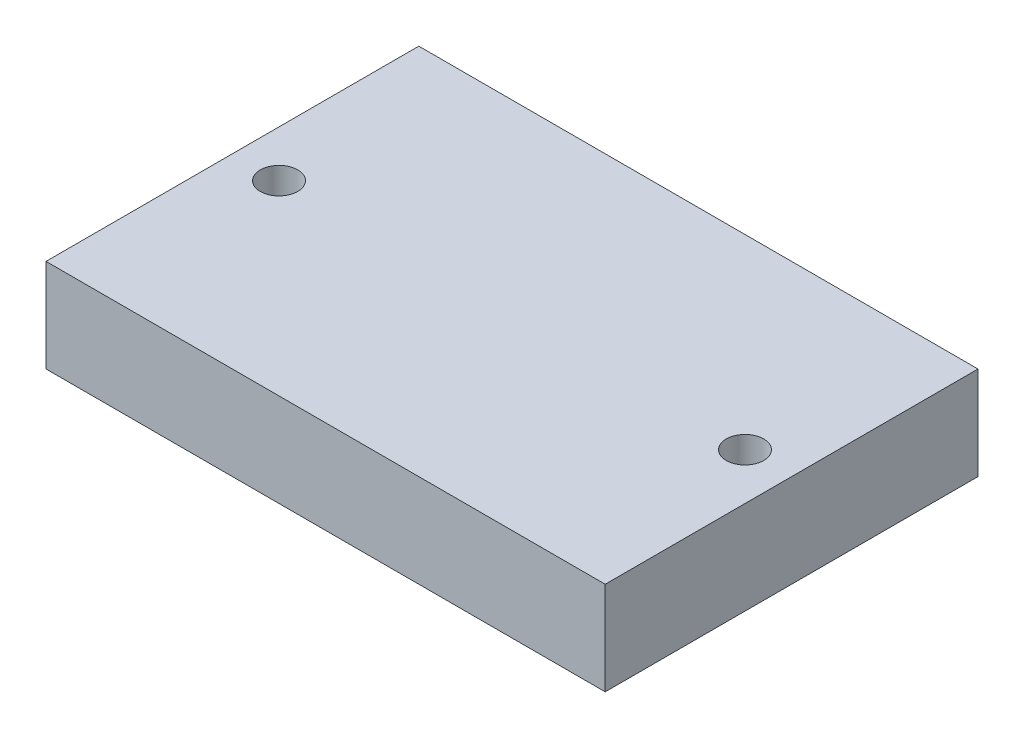
ISO-10303-21;
HEADER;
FILE_DESCRIPTION(('STEP AP214'),'2;1');
FILE_NAME('part.step','',(''),(''),'','','');
FILE_SCHEMA(('AUTOMOTIVE_DESIGN { 1 0 10303 214 1 1 1 1 }'));
ENDSEC;
DATA;
#1=APPLICATION_CONTEXT('core data for automotive mechanical design processes');
#2=APPLICATION_PROTOCOL_DEFINITION('international standard','automotive_design',2000,#1);
#3=PRODUCT_CONTEXT('',#1,'mechanical');
#4=PRODUCT('Part','Part','',(#3));
#5=PRODUCT_RELATED_PRODUCT_CATEGORY('part','',(#4));
#6=PRODUCT_DEFINITION_FORMATION('','',#4);
#7=PRODUCT_DEFINITION_CONTEXT('part definition',#1,'design');
#8=PRODUCT_DEFINITION('design','',#6,#7);
#9=PRODUCT_DEFINITION_SHAPE('','',#8);
#10=(LENGTH_UNIT() NAMED_UNIT(*) SI_UNIT(.MILLI.,.METRE.));
#11=(NAMED_UNIT(*) PLANE_ANGLE_UNIT() SI_UNIT($,.RADIAN.));
#12=(NAMED_UNIT(*) SI_UNIT($,.STERADIAN.) SOLID_ANGLE_UNIT());
#13=UNCERTAINTY_MEASURE_WITH_UNIT(LENGTH_MEASURE(1.E-05),#10,'distance_accuracy_value','');
#14=(GEOMETRIC_REPRESENTATION_CONTEXT(3) GLOBAL_UNCERTAINTY_ASSIGNED_CONTEXT((#13)) GLOBAL_UNIT_ASSIGNED_CONTEXT((#10,
#11,#12)) REPRESENTATION_CONTEXT('',''));
#15=CARTESIAN_POINT('',(0.,0.,0.));
#16=DIRECTION('',(0.,0.,1.));
#17=DIRECTION('',(1.,0.,0.));
#18=AXIS2_PLACEMENT_3D('',#15,#16,#17);
#19=CARTESIAN_POINT('',(-38.1,12.7,25.4));
#20=DIRECTION('',(-1.,0.,0.));
#21=DIRECTION('',(0.,0.,1.));
#22=AXIS2_PLACEMENT_3D('',#19,#20,#21);
#23=PLANE('',#22);
#24=DIRECTION('',(0.,0.,-1.));
#25=VECTOR('',#24,1.);
#26=CARTESIAN_POINT('',(-38.1,0.,25.4));
#27=LINE('',#26,#25);
#28=CARTESIAN_POINT('',(-38.1,0.,25.4));
#29=VERTEX_POINT('',#28);
#30=CARTESIAN_POINT('',(-38.1,0.,-25.4));
#31=VERTEX_POINT('',#30);
#32=EDGE_CURVE('E105',#29,#31,#27,.T.);
#33=ORIENTED_EDGE('',*,*,#32,.F.);
#34=DIRECTION('',(0.,-1.,0.));
#35=VECTOR('',#34,1.);
#36=CARTESIAN_POINT('',(-38.1,12.7,25.4));
#37=LINE('',#36,#35);
#38=CARTESIAN_POINT('',(-38.1,12.7,25.4));
#39=VERTEX_POINT('',#38);
#40=EDGE_CURVE('E11',#39,#29,#37,.T.);
#41=ORIENTED_EDGE('',*,*,#40,.F.);
#42=DIRECTION('',(0.,0.,-1.));
#43=VECTOR('',#42,1.);
#44=CARTESIAN_POINT('',(-38.1,12.7,25.4));
#45=LINE('',#44,#43);
#46=CARTESIAN_POINT('',(-38.1,12.7,-25.4));
#47=VERTEX_POINT('',#46);
#48=EDGE_CURVE('E99',#39,#47,#45,.T.);
#49=ORIENTED_EDGE('',*,*,#48,.T.);
#50=DIRECTION('',(0.,-1.,0.));
#51=VECTOR('',#50,1.);
#52=CARTESIAN_POINT('',(-38.1,12.7,-25.4));
#53=LINE('',#52,#51);
#54=EDGE_CURVE('E42',#47,#31,#53,.T.);
#55=ORIENTED_EDGE('',*,*,#54,.T.);
#56=EDGE_LOOP('',(#33,#41,#49,#55));
#57=FACE_BOUND('',#56,.T.);
#58=ADVANCED_FACE('F39',(#57),#23,.T.);
#59=CARTESIAN_POINT('',(-38.1,12.7,25.4));
#60=DIRECTION('',(0.,0.,-1.));
#61=DIRECTION('',(-1.,0.,0.));
#62=AXIS2_PLACEMENT_3D('',#59,#60,#61);
#63=PLANE('',#62);
#64=DIRECTION('',(1.,0.,0.));
#65=VECTOR('',#64,1.);
#66=CARTESIAN_POINT('',(-38.1,0.,25.4));
#67=LINE('',#66,#65);
#68=CARTESIAN_POINT('',(38.1,0.,25.4));
#69=VERTEX_POINT('',#68);
#70=EDGE_CURVE('E72',#29,#69,#67,.T.);
#71=ORIENTED_EDGE('',*,*,#70,.T.);
#72=DIRECTION('',(0.,-1.,0.));
#73=VECTOR('',#72,1.);
#74=CARTESIAN_POINT('',(38.1,12.7,25.4));
#75=LINE('',#74,#73);
#76=CARTESIAN_POINT('',(38.1,12.7,25.4));
#77=VERTEX_POINT('',#76);
#78=EDGE_CURVE('E48',#77,#69,#75,.T.);
#79=ORIENTED_EDGE('',*,*,#78,.F.);
#80=DIRECTION('',(1.,0.,0.));
#81=VECTOR('',#80,1.);
#82=CARTESIAN_POINT('',(-38.1,12.7,25.4));
#83=LINE('',#82,#81);
#84=EDGE_CURVE('E89',#39,#77,#83,.T.);
#85=ORIENTED_EDGE('',*,*,#84,.F.);
#86=ORIENTED_EDGE('',*,*,#40,.T.);
#87=EDGE_LOOP('',(#71,#79,#85,#86));
#88=FACE_BOUND('',#87,.T.);
#89=ADVANCED_FACE('F116',(#88),#63,.F.);
#90=CARTESIAN_POINT('',(38.1,12.7,25.4));
#91=DIRECTION('',(-1.,0.,0.));
#92=DIRECTION('',(0.,0.,1.));
#93=AXIS2_PLACEMENT_3D('',#90,#91,#92);
#94=PLANE('',#93);
#95=DIRECTION('',(0.,0.,-1.));
#96=VECTOR('',#95,1.);
#97=CARTESIAN_POINT('',(38.1,0.,25.4));
#98=LINE('',#97,#96);
#99=CARTESIAN_POINT('',(38.1,0.,-25.4));
#100=VERTEX_POINT('',#99);
#101=EDGE_CURVE('E96',#69,#100,#98,.T.);
#102=ORIENTED_EDGE('',*,*,#101,.T.);
#103=DIRECTION('',(0.,-1.,0.));
#104=VECTOR('',#103,1.);
#105=CARTESIAN_POINT('',(38.1,12.7,-25.4));
#106=LINE('',#105,#104);
#107=CARTESIAN_POINT('',(38.1,12.7,-25.4));
#108=VERTEX_POINT('',#107);
#109=EDGE_CURVE('E93',#108,#100,#106,.T.);
#110=ORIENTED_EDGE('',*,*,#109,.F.);
#111=DIRECTION('',(0.,0.,-1.));
#112=VECTOR('',#111,1.);
#113=CARTESIAN_POINT('',(38.1,12.7,25.4));
#114=LINE('',#113,#112);
#115=EDGE_CURVE('E84',#77,#108,#114,.T.);
#116=ORIENTED_EDGE('',*,*,#115,.F.);
#117=ORIENTED_EDGE('',*,*,#78,.T.);
#118=EDGE_LOOP('',(#102,#110,#116,#117));
#119=FACE_BOUND('',#118,.T.);
#120=ADVANCED_FACE('F94',(#119),#94,.F.);
#121=CARTESIAN_POINT('',(-38.1,12.7,-25.4));
#122=DIRECTION('',(0.,0.,-1.));
#123=DIRECTION('',(-1.,0.,0.));
#124=AXIS2_PLACEMENT_3D('',#121,#122,#123);
#125=PLANE('',#124);
#126=DIRECTION('',(1.,0.,0.));
#127=VECTOR('',#126,1.);
#128=CARTESIAN_POINT('',(-38.1,0.,-25.4));
#129=LINE('',#128,#127);
#130=EDGE_CURVE('E108',#31,#100,#129,.T.);
#131=ORIENTED_EDGE('',*,*,#130,.F.);
#132=ORIENTED_EDGE('',*,*,#54,.F.);
#133=DIRECTION('',(1.,0.,0.));
#134=VECTOR('',#133,1.);
#135=CARTESIAN_POINT('',(-38.1,12.7,-25.4));
#136=LINE('',#135,#134);
#137=EDGE_CURVE('E88',#47,#108,#136,.T.);
#138=ORIENTED_EDGE('',*,*,#137,.T.);
#139=ORIENTED_EDGE('',*,*,#109,.T.);
#140=EDGE_LOOP('',(#131,#132,#138,#139));
#141=FACE_BOUND('',#140,.T.);
#142=ADVANCED_FACE('F98',(#141),#125,.T.);
#143=CARTESIAN_POINT('',(0.,12.7,0.));
#144=DIRECTION('',(0.,-1.,0.));
#145=DIRECTION('',(0.,0.,-1.));
#146=AXIS2_PLACEMENT_3D('',#143,#144,#145);
#147=PLANE('',#146);
#148=CARTESIAN_POINT('',(-31.75,12.7,0.));
#149=DIRECTION('',(0.,1.,0.));
#150=DIRECTION('',(0.,0.,1.));
#151=AXIS2_PLACEMENT_3D('',#148,#149,#150);
#152=CIRCLE('',#151,2.55269999999999);
#153=CARTESIAN_POINT('',(-31.75,12.7,2.55269999999999));
#154=VERTEX_POINT('',#153);
#155=EDGE_CURVE('E153',#154,#154,#152,.T.);
#156=ORIENTED_EDGE('',*,*,#155,.F.);
#157=EDGE_LOOP('',(#156));
#158=FACE_BOUND('',#157,.T.);
#159=CARTESIAN_POINT('',(31.75,12.7,0.));
#160=DIRECTION('',(0.,1.,0.));
#161=DIRECTION('',(0.,0.,1.));
#162=AXIS2_PLACEMENT_3D('',#159,#160,#161);
#163=CIRCLE('',#162,2.55269999999999);
#164=CARTESIAN_POINT('',(31.75,12.7,2.55269999999999));
#165=VERTEX_POINT('',#164);
#166=EDGE_CURVE('E155',#165,#165,#163,.T.);
#167=ORIENTED_EDGE('',*,*,#166,.F.);
#168=EDGE_LOOP('',(#167));
#169=FACE_BOUND('',#168,.T.);
#170=ORIENTED_EDGE('',*,*,#48,.F.);
#171=ORIENTED_EDGE('',*,*,#84,.T.);
#172=ORIENTED_EDGE('',*,*,#115,.T.);
#173=ORIENTED_EDGE('',*,*,#137,.F.);
#174=EDGE_LOOP('',(#170,#171,#172,#173));
#175=FACE_BOUND('',#174,.T.);
#176=ADVANCED_FACE('F87',(#158,#169,#175),#147,.F.);
#177=CARTESIAN_POINT('',(0.,0.,0.));
#178=DIRECTION('',(0.,-1.,0.));
#179=DIRECTION('',(0.,0.,-1.));
#180=AXIS2_PLACEMENT_3D('',#177,#178,#179);
#181=PLANE('',#180);
#182=CARTESIAN_POINT('',(-31.75,0.,0.));
#183=DIRECTION('',(0.,1.,0.));
#184=DIRECTION('',(0.,0.,1.));
#185=AXIS2_PLACEMENT_3D('',#182,#183,#184);
#186=CIRCLE('',#185,2.5527);
#187=CARTESIAN_POINT('',(-31.75,0.,2.5527));
#188=VERTEX_POINT('',#187);
#189=EDGE_CURVE('E151',#188,#188,#186,.T.);
#190=ORIENTED_EDGE('',*,*,#189,.T.);
#191=EDGE_LOOP('',(#190));
#192=FACE_BOUND('',#191,.T.);
#193=CARTESIAN_POINT('',(31.75,0.,0.));
#194=DIRECTION('',(0.,1.,0.));
#195=DIRECTION('',(0.,0.,1.));
#196=AXIS2_PLACEMENT_3D('',#193,#194,#195);
#197=CIRCLE('',#196,2.5527);
#198=CARTESIAN_POINT('',(31.75,0.,2.5527));
#199=VERTEX_POINT('',#198);
#200=EDGE_CURVE('E109',#199,#199,#197,.T.);
#201=ORIENTED_EDGE('',*,*,#200,.T.);
#202=EDGE_LOOP('',(#201));
#203=FACE_BOUND('',#202,.T.);
#204=ORIENTED_EDGE('',*,*,#32,.T.);
#205=ORIENTED_EDGE('',*,*,#130,.T.);
#206=ORIENTED_EDGE('',*,*,#101,.F.);
#207=ORIENTED_EDGE('',*,*,#70,.F.);
#208=EDGE_LOOP('',(#204,#205,#206,#207));
#209=FACE_BOUND('',#208,.T.);
#210=ADVANCED_FACE('F114',(#192,#203,#209),#181,.T.);
#211=CARTESIAN_POINT('',(31.75,12.7,0.));
#212=DIRECTION('',(0.,1.,0.));
#213=DIRECTION('',(0.,0.,1.));
#214=AXIS2_PLACEMENT_3D('',#211,#212,#213);
#215=CYLINDRICAL_SURFACE('',#214,2.55269999999999);
#216=ORIENTED_EDGE('',*,*,#200,.F.);
#217=EDGE_LOOP('',(#216));
#218=FACE_BOUND('',#217,.T.);
#219=ORIENTED_EDGE('',*,*,#166,.T.);
#220=EDGE_LOOP('',(#219));
#221=FACE_BOUND('',#220,.T.);
#222=ADVANCED_FACE('F135',(#218,#221),#215,.F.);
#223=CARTESIAN_POINT('',(-31.75,12.7,0.));
#224=DIRECTION('',(0.,1.,0.));
#225=DIRECTION('',(0.,0.,1.));
#226=AXIS2_PLACEMENT_3D('',#223,#224,#225);
#227=CYLINDRICAL_SURFACE('',#226,2.55269999999999);
#228=ORIENTED_EDGE('',*,*,#189,.F.);
#229=EDGE_LOOP('',(#228));
#230=FACE_BOUND('',#229,.T.);
#231=ORIENTED_EDGE('',*,*,#155,.T.);
#232=EDGE_LOOP('',(#231));
#233=FACE_BOUND('',#232,.T.);
#234=ADVANCED_FACE('F142',(#230,#233),#227,.F.);
#235=CLOSED_SHELL('',(#58,#89,#120,#142,#176,#210,#222,#234));
#236=MANIFOLD_SOLID_BREP('B2',#235);
#237=ADVANCED_BREP_SHAPE_REPRESENTATION('',(#18,#236),#14);
#238=SHAPE_DEFINITION_REPRESENTATION(#9,#237);
ENDSEC;
END-ISO-10303-21;
